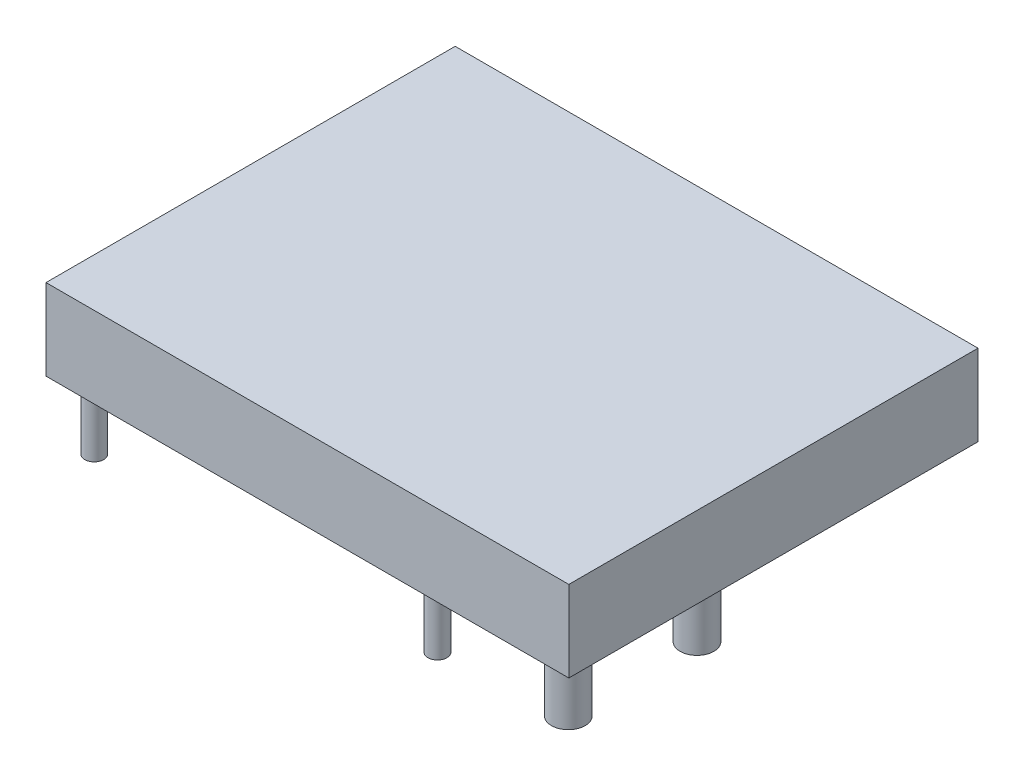
ISO-10303-21;
HEADER;
FILE_DESCRIPTION(('STEP AP214'),'2;1');
FILE_NAME('part.step','',(''),(''),'','','');
FILE_SCHEMA(('AUTOMOTIVE_DESIGN { 1 0 10303 214 1 1 1 1 }'));
ENDSEC;
DATA;
#1=APPLICATION_CONTEXT('core data for automotive mechanical design processes');
#2=APPLICATION_PROTOCOL_DEFINITION('international standard','automotive_design',2000,#1);
#3=PRODUCT_CONTEXT('',#1,'mechanical');
#4=PRODUCT('Part','Part','',(#3));
#5=PRODUCT_RELATED_PRODUCT_CATEGORY('part','',(#4));
#6=PRODUCT_DEFINITION_FORMATION('','',#4);
#7=PRODUCT_DEFINITION_CONTEXT('part definition',#1,'design');
#8=PRODUCT_DEFINITION('design','',#6,#7);
#9=PRODUCT_DEFINITION_SHAPE('','',#8);
#10=(LENGTH_UNIT() NAMED_UNIT(*) SI_UNIT(.MILLI.,.METRE.));
#11=(NAMED_UNIT(*) PLANE_ANGLE_UNIT() SI_UNIT($,.RADIAN.));
#12=(NAMED_UNIT(*) SI_UNIT($,.STERADIAN.) SOLID_ANGLE_UNIT());
#13=UNCERTAINTY_MEASURE_WITH_UNIT(LENGTH_MEASURE(1.E-05),#10,'distance_accuracy_value','');
#14=(GEOMETRIC_REPRESENTATION_CONTEXT(3) GLOBAL_UNCERTAINTY_ASSIGNED_CONTEXT((#13)) GLOBAL_UNIT_ASSIGNED_CONTEXT((#10,
#11,#12)) REPRESENTATION_CONTEXT('',''));
#15=CARTESIAN_POINT('',(0.,0.,0.));
#16=DIRECTION('',(0.,0.,1.));
#17=DIRECTION('',(1.,0.,0.));
#18=AXIS2_PLACEMENT_3D('',#15,#16,#17);
#19=CARTESIAN_POINT('',(0.,8.,0.));
#20=DIRECTION('',(0.,1.,0.));
#21=DIRECTION('',(0.,0.,1.));
#22=AXIS2_PLACEMENT_3D('',#19,#20,#21);
#23=PLANE('',#22);
#24=DIRECTION('',(0.,0.,-1.));
#25=VECTOR('',#24,1.);
#26=CARTESIAN_POINT('',(-60.32012,8.,0.));
#27=LINE('',#26,#25);
#28=CARTESIAN_POINT('',(-60.32012,8.,1.60000000000001));
#29=VERTEX_POINT('',#28);
#30=CARTESIAN_POINT('',(-60.32012,8.,-46.86185));
#31=VERTEX_POINT('',#30);
#32=EDGE_CURVE('E104',#29,#31,#27,.T.);
#33=ORIENTED_EDGE('',*,*,#32,.T.);
#34=DIRECTION('',(1.,0.,0.));
#35=VECTOR('',#34,1.);
#36=CARTESIAN_POINT('',(0.,8.,-46.86185));
#37=LINE('',#36,#35);
#38=CARTESIAN_POINT('',(1.6,8.,-46.86185));
#39=VERTEX_POINT('',#38);
#40=EDGE_CURVE('E54',#31,#39,#37,.T.);
#41=ORIENTED_EDGE('',*,*,#40,.T.);
#42=DIRECTION('',(0.,0.,-1.));
#43=VECTOR('',#42,1.);
#44=CARTESIAN_POINT('',(1.6,8.,0.));
#45=LINE('',#44,#43);
#46=CARTESIAN_POINT('',(1.6,8.,1.6));
#47=VERTEX_POINT('',#46);
#48=EDGE_CURVE('E162',#47,#39,#45,.T.);
#49=ORIENTED_EDGE('',*,*,#48,.F.);
#50=DIRECTION('',(-1.,0.,0.));
#51=VECTOR('',#50,1.);
#52=CARTESIAN_POINT('',(0.,8.,1.6));
#53=LINE('',#52,#51);
#54=EDGE_CURVE('E164',#47,#29,#53,.T.);
#55=ORIENTED_EDGE('',*,*,#54,.T.);
#56=EDGE_LOOP('',(#33,#41,#49,#55));
#57=FACE_BOUND('',#56,.T.);
#58=DIRECTION('',(-1.,0.,0.));
#59=VECTOR('',#58,1.);
#60=CARTESIAN_POINT('',(0.,8.,0.));
#61=LINE('',#60,#59);
#62=CARTESIAN_POINT('',(0.,8.,0.));
#63=VERTEX_POINT('',#62);
#64=CARTESIAN_POINT('',(-58.72012,8.,0.));
#65=VERTEX_POINT('',#64);
#66=EDGE_CURVE('E155',#63,#65,#61,.T.);
#67=ORIENTED_EDGE('',*,*,#66,.F.);
#68=DIRECTION('',(0.,0.,-1.));
#69=VECTOR('',#68,1.);
#70=CARTESIAN_POINT('',(0.,8.,0.));
#71=LINE('',#70,#69);
#72=CARTESIAN_POINT('',(0.,8.,-45.26185));
#73=VERTEX_POINT('',#72);
#74=EDGE_CURVE('E46',#63,#73,#71,.T.);
#75=ORIENTED_EDGE('',*,*,#74,.T.);
#76=DIRECTION('',(1.,0.,0.));
#77=VECTOR('',#76,1.);
#78=CARTESIAN_POINT('',(0.,8.,-45.26185));
#79=LINE('',#78,#77);
#80=CARTESIAN_POINT('',(-58.72012,8.,-45.26185));
#81=VERTEX_POINT('',#80);
#82=EDGE_CURVE('E133',#81,#73,#79,.T.);
#83=ORIENTED_EDGE('',*,*,#82,.F.);
#84=DIRECTION('',(0.,0.,-1.));
#85=VECTOR('',#84,1.);
#86=CARTESIAN_POINT('',(-58.72012,8.,0.));
#87=LINE('',#86,#85);
#88=EDGE_CURVE('E160',#65,#81,#87,.T.);
#89=ORIENTED_EDGE('',*,*,#88,.F.);
#90=EDGE_LOOP('',(#67,#75,#83,#89));
#91=FACE_BOUND('',#90,.T.);
#92=ADVANCED_FACE('F32',(#57,#91),#23,.F.);
#93=CARTESIAN_POINT('',(0.,16.,0.));
#94=DIRECTION('',(0.,0.,1.));
#95=DIRECTION('',(1.,0.,0.));
#96=AXIS2_PLACEMENT_3D('',#93,#94,#95);
#97=PLANE('',#96);
#98=DIRECTION('',(0.,-1.,0.));
#99=VECTOR('',#98,1.);
#100=CARTESIAN_POINT('',(0.,16.,0.));
#101=LINE('',#100,#99);
#102=CARTESIAN_POINT('',(0.,16.,0.));
#103=VERTEX_POINT('',#102);
#104=EDGE_CURVE('E139',#103,#63,#101,.T.);
#105=ORIENTED_EDGE('',*,*,#104,.T.);
#106=ORIENTED_EDGE('',*,*,#66,.T.);
#107=DIRECTION('',(0.,-1.,0.));
#108=VECTOR('',#107,1.);
#109=CARTESIAN_POINT('',(-58.72012,16.,0.));
#110=LINE('',#109,#108);
#111=CARTESIAN_POINT('',(-58.72012,16.,0.));
#112=VERTEX_POINT('',#111);
#113=EDGE_CURVE('E142',#112,#65,#110,.T.);
#114=ORIENTED_EDGE('',*,*,#113,.F.);
#115=DIRECTION('',(-1.,0.,0.));
#116=VECTOR('',#115,1.);
#117=CARTESIAN_POINT('',(0.,16.,0.));
#118=LINE('',#117,#116);
#119=EDGE_CURVE('E145',#103,#112,#118,.T.);
#120=ORIENTED_EDGE('',*,*,#119,.F.);
#121=EDGE_LOOP('',(#105,#106,#114,#120));
#122=FACE_BOUND('',#121,.T.);
#123=ADVANCED_FACE('F187',(#122),#97,.F.);
#124=CARTESIAN_POINT('',(0.,16.,0.));
#125=DIRECTION('',(0.,1.,0.));
#126=DIRECTION('',(0.,0.,1.));
#127=AXIS2_PLACEMENT_3D('',#124,#125,#126);
#128=PLANE('',#127);
#129=CARTESIAN_POINT('',(-16.82012,16.,-1.26000000000001));
#130=DIRECTION('',(0.,1.,0.));
#131=DIRECTION('',(0.,0.,1.));
#132=AXIS2_PLACEMENT_3D('',#129,#130,#131);
#133=CIRCLE('',#132,1.125);
#134=CARTESIAN_POINT('',(-16.82012,16.,-0.13500000000001));
#135=VERTEX_POINT('',#134);
#136=EDGE_CURVE('E11',#135,#135,#133,.F.);
#137=ORIENTED_EDGE('',*,*,#136,.F.);
#138=EDGE_LOOP('',(#137));
#139=FACE_BOUND('',#138,.T.);
#140=CARTESIAN_POINT('',(-16.82012,16.,-16.5));
#141=DIRECTION('',(0.,1.,0.));
#142=DIRECTION('',(0.,0.,1.));
#143=AXIS2_PLACEMENT_3D('',#140,#141,#142);
#144=CIRCLE('',#143,1.125);
#145=CARTESIAN_POINT('',(-16.82012,16.,-15.375));
#146=VERTEX_POINT('',#145);
#147=EDGE_CURVE('E39',#146,#146,#144,.F.);
#148=ORIENTED_EDGE('',*,*,#147,.F.);
#149=EDGE_LOOP('',(#148));
#150=FACE_BOUND('',#149,.T.);
#151=CARTESIAN_POINT('',(-57.46012,16.,-16.5));
#152=DIRECTION('',(0.,1.,0.));
#153=DIRECTION('',(0.,0.,1.));
#154=AXIS2_PLACEMENT_3D('',#151,#152,#153);
#155=CIRCLE('',#154,1.125);
#156=CARTESIAN_POINT('',(-57.46012,16.,-15.375));
#157=VERTEX_POINT('',#156);
#158=EDGE_CURVE('E176',#157,#157,#155,.F.);
#159=ORIENTED_EDGE('',*,*,#158,.F.);
#160=EDGE_LOOP('',(#159));
#161=FACE_BOUND('',#160,.T.);
#162=CARTESIAN_POINT('',(-57.46012,16.,-1.26000000000001));
#163=DIRECTION('',(0.,1.,0.));
#164=DIRECTION('',(0.,0.,1.));
#165=AXIS2_PLACEMENT_3D('',#162,#163,#164);
#166=CIRCLE('',#165,1.125);
#167=CARTESIAN_POINT('',(-57.46012,16.,-0.13500000000001));
#168=VERTEX_POINT('',#167);
#169=EDGE_CURVE('E173',#168,#168,#166,.F.);
#170=ORIENTED_EDGE('',*,*,#169,.F.);
#171=EDGE_LOOP('',(#170));
#172=FACE_BOUND('',#171,.T.);
#173=CARTESIAN_POINT('',(-2.54,16.,-2.48185));
#174=DIRECTION('',(0.,1.,0.));
#175=DIRECTION('',(0.,0.,1.));
#176=AXIS2_PLACEMENT_3D('',#173,#174,#175);
#177=CIRCLE('',#176,2.);
#178=CARTESIAN_POINT('',(-2.54,16.,-0.481849999999997));
#179=VERTEX_POINT('',#178);
#180=EDGE_CURVE('E170',#179,#179,#177,.F.);
#181=ORIENTED_EDGE('',*,*,#180,.F.);
#182=EDGE_LOOP('',(#181));
#183=FACE_BOUND('',#182,.T.);
#184=CARTESIAN_POINT('',(-2.54,16.,-17.72185));
#185=DIRECTION('',(0.,1.,0.));
#186=DIRECTION('',(0.,0.,1.));
#187=AXIS2_PLACEMENT_3D('',#184,#185,#186);
#188=CIRCLE('',#187,2.);
#189=CARTESIAN_POINT('',(-2.54,16.,-15.72185));
#190=VERTEX_POINT('',#189);
#191=EDGE_CURVE('E157',#190,#190,#188,.F.);
#192=ORIENTED_EDGE('',*,*,#191,.F.);
#193=EDGE_LOOP('',(#192));
#194=FACE_BOUND('',#193,.T.);
#195=DIRECTION('',(1.,0.,0.));
#196=VECTOR('',#195,1.);
#197=CARTESIAN_POINT('',(0.,16.,-45.26185));
#198=LINE('',#197,#196);
#199=CARTESIAN_POINT('',(-58.72012,16.,-45.26185));
#200=VERTEX_POINT('',#199);
#201=CARTESIAN_POINT('',(0.,16.,-45.26185));
#202=VERTEX_POINT('',#201);
#203=EDGE_CURVE('E136',#200,#202,#198,.T.);
#204=ORIENTED_EDGE('',*,*,#203,.T.);
#205=DIRECTION('',(0.,0.,-1.));
#206=VECTOR('',#205,1.);
#207=CARTESIAN_POINT('',(0.,16.,0.));
#208=LINE('',#207,#206);
#209=EDGE_CURVE('E131',#103,#202,#208,.T.);
#210=ORIENTED_EDGE('',*,*,#209,.F.);
#211=ORIENTED_EDGE('',*,*,#119,.T.);
#212=DIRECTION('',(0.,0.,-1.));
#213=VECTOR('',#212,1.);
#214=CARTESIAN_POINT('',(-58.72012,16.,0.));
#215=LINE('',#214,#213);
#216=EDGE_CURVE('E151',#112,#200,#215,.T.);
#217=ORIENTED_EDGE('',*,*,#216,.T.);
#218=EDGE_LOOP('',(#204,#210,#211,#217));
#219=FACE_BOUND('',#218,.T.);
#220=ADVANCED_FACE('F183',(#139,#150,#161,#172,#183,#194,#219),#128,.F.);
#221=CARTESIAN_POINT('',(0.,16.,0.));
#222=DIRECTION('',(-1.,0.,0.));
#223=DIRECTION('',(0.,0.,1.));
#224=AXIS2_PLACEMENT_3D('',#221,#222,#223);
#225=PLANE('',#224);
#226=ORIENTED_EDGE('',*,*,#74,.F.);
#227=ORIENTED_EDGE('',*,*,#104,.F.);
#228=ORIENTED_EDGE('',*,*,#209,.T.);
#229=DIRECTION('',(0.,-1.,0.));
#230=VECTOR('',#229,1.);
#231=CARTESIAN_POINT('',(0.,16.,-45.26185));
#232=LINE('',#231,#230);
#233=EDGE_CURVE('E134',#202,#73,#232,.T.);
#234=ORIENTED_EDGE('',*,*,#233,.T.);
#235=EDGE_LOOP('',(#226,#227,#228,#234));
#236=FACE_BOUND('',#235,.T.);
#237=ADVANCED_FACE('F186',(#236),#225,.T.);
#238=CARTESIAN_POINT('',(-58.72012,16.,0.));
#239=DIRECTION('',(-1.,0.,0.));
#240=DIRECTION('',(0.,0.,1.));
#241=AXIS2_PLACEMENT_3D('',#238,#239,#240);
#242=PLANE('',#241);
#243=ORIENTED_EDGE('',*,*,#113,.T.);
#244=ORIENTED_EDGE('',*,*,#88,.T.);
#245=DIRECTION('',(0.,-1.,0.));
#246=VECTOR('',#245,1.);
#247=CARTESIAN_POINT('',(-58.72012,16.,-45.26185));
#248=LINE('',#247,#246);
#249=EDGE_CURVE('E148',#200,#81,#248,.T.);
#250=ORIENTED_EDGE('',*,*,#249,.F.);
#251=ORIENTED_EDGE('',*,*,#216,.F.);
#252=EDGE_LOOP('',(#243,#244,#250,#251));
#253=FACE_BOUND('',#252,.T.);
#254=ADVANCED_FACE('F209',(#253),#242,.F.);
#255=CARTESIAN_POINT('',(0.,16.,-45.26185));
#256=DIRECTION('',(0.,0.,-1.));
#257=DIRECTION('',(-1.,0.,0.));
#258=AXIS2_PLACEMENT_3D('',#255,#256,#257);
#259=PLANE('',#258);
#260=ORIENTED_EDGE('',*,*,#249,.T.);
#261=ORIENTED_EDGE('',*,*,#82,.T.);
#262=ORIENTED_EDGE('',*,*,#233,.F.);
#263=ORIENTED_EDGE('',*,*,#203,.F.);
#264=EDGE_LOOP('',(#260,#261,#262,#263));
#265=FACE_BOUND('',#264,.T.);
#266=ADVANCED_FACE('F205',(#265),#259,.F.);
#267=CARTESIAN_POINT('',(-60.32012,16.,0.));
#268=DIRECTION('',(-1.,0.,0.));
#269=DIRECTION('',(0.,0.,1.));
#270=AXIS2_PLACEMENT_3D('',#267,#268,#269);
#271=PLANE('',#270);
#272=ORIENTED_EDGE('',*,*,#32,.F.);
#273=DIRECTION('',(0.,-1.,0.));
#274=VECTOR('',#273,1.);
#275=CARTESIAN_POINT('',(-60.32012,16.,1.60000000000001));
#276=LINE('',#275,#274);
#277=CARTESIAN_POINT('',(-60.32012,17.6,1.60000000000001));
#278=VERTEX_POINT('',#277);
#279=EDGE_CURVE('E99',#278,#29,#276,.T.);
#280=ORIENTED_EDGE('',*,*,#279,.F.);
#281=DIRECTION('',(0.,0.,-1.));
#282=VECTOR('',#281,1.);
#283=CARTESIAN_POINT('',(-60.32012,17.6,0.));
#284=LINE('',#283,#282);
#285=CARTESIAN_POINT('',(-60.32012,17.6,-46.86185));
#286=VERTEX_POINT('',#285);
#287=EDGE_CURVE('E103',#278,#286,#284,.T.);
#288=ORIENTED_EDGE('',*,*,#287,.T.);
#289=DIRECTION('',(0.,-1.,0.));
#290=VECTOR('',#289,1.);
#291=CARTESIAN_POINT('',(-60.32012,16.,-46.86185));
#292=LINE('',#291,#290);
#293=EDGE_CURVE('E107',#286,#31,#292,.T.);
#294=ORIENTED_EDGE('',*,*,#293,.T.);
#295=EDGE_LOOP('',(#272,#280,#288,#294));
#296=FACE_BOUND('',#295,.T.);
#297=ADVANCED_FACE('F101',(#296),#271,.T.);
#298=CARTESIAN_POINT('',(0.,16.,1.6));
#299=DIRECTION('',(0.,0.,1.));
#300=DIRECTION('',(1.,0.,0.));
#301=AXIS2_PLACEMENT_3D('',#298,#299,#300);
#302=PLANE('',#301);
#303=ORIENTED_EDGE('',*,*,#54,.F.);
#304=DIRECTION('',(0.,-1.,0.));
#305=VECTOR('',#304,1.);
#306=CARTESIAN_POINT('',(1.6,16.,1.6));
#307=LINE('',#306,#305);
#308=CARTESIAN_POINT('',(1.6,17.6,1.6));
#309=VERTEX_POINT('',#308);
#310=EDGE_CURVE('E108',#309,#47,#307,.T.);
#311=ORIENTED_EDGE('',*,*,#310,.F.);
#312=DIRECTION('',(-1.,0.,0.));
#313=VECTOR('',#312,1.);
#314=CARTESIAN_POINT('',(0.,17.6,1.6));
#315=LINE('',#314,#313);
#316=EDGE_CURVE('E114',#309,#278,#315,.T.);
#317=ORIENTED_EDGE('',*,*,#316,.T.);
#318=ORIENTED_EDGE('',*,*,#279,.T.);
#319=EDGE_LOOP('',(#303,#311,#317,#318));
#320=FACE_BOUND('',#319,.T.);
#321=ADVANCED_FACE('F118',(#320),#302,.T.);
#322=CARTESIAN_POINT('',(1.6,16.,0.));
#323=DIRECTION('',(-1.,0.,0.));
#324=DIRECTION('',(0.,0.,1.));
#325=AXIS2_PLACEMENT_3D('',#322,#323,#324);
#326=PLANE('',#325);
#327=ORIENTED_EDGE('',*,*,#310,.T.);
#328=ORIENTED_EDGE('',*,*,#48,.T.);
#329=DIRECTION('',(0.,-1.,0.));
#330=VECTOR('',#329,1.);
#331=CARTESIAN_POINT('',(1.6,16.,-46.86185));
#332=LINE('',#331,#330);
#333=CARTESIAN_POINT('',(1.6,17.6,-46.86185));
#334=VERTEX_POINT('',#333);
#335=EDGE_CURVE('E123',#334,#39,#332,.T.);
#336=ORIENTED_EDGE('',*,*,#335,.F.);
#337=DIRECTION('',(0.,0.,-1.));
#338=VECTOR('',#337,1.);
#339=CARTESIAN_POINT('',(1.6,17.6,0.));
#340=LINE('',#339,#338);
#341=EDGE_CURVE('E121',#309,#334,#340,.T.);
#342=ORIENTED_EDGE('',*,*,#341,.F.);
#343=EDGE_LOOP('',(#327,#328,#336,#342));
#344=FACE_BOUND('',#343,.T.);
#345=ADVANCED_FACE('F228',(#344),#326,.F.);
#346=CARTESIAN_POINT('',(0.,16.,-46.86185));
#347=DIRECTION('',(0.,0.,-1.));
#348=DIRECTION('',(-1.,0.,0.));
#349=AXIS2_PLACEMENT_3D('',#346,#347,#348);
#350=PLANE('',#349);
#351=ORIENTED_EDGE('',*,*,#40,.F.);
#352=ORIENTED_EDGE('',*,*,#293,.F.);
#353=DIRECTION('',(1.,0.,0.));
#354=VECTOR('',#353,1.);
#355=CARTESIAN_POINT('',(0.,17.6,-46.86185));
#356=LINE('',#355,#354);
#357=EDGE_CURVE('E116',#286,#334,#356,.T.);
#358=ORIENTED_EDGE('',*,*,#357,.T.);
#359=ORIENTED_EDGE('',*,*,#335,.T.);
#360=EDGE_LOOP('',(#351,#352,#358,#359));
#361=FACE_BOUND('',#360,.T.);
#362=ADVANCED_FACE('F219',(#361),#350,.T.);
#363=CARTESIAN_POINT('',(0.,17.6,0.));
#364=DIRECTION('',(0.,1.,0.));
#365=DIRECTION('',(0.,0.,1.));
#366=AXIS2_PLACEMENT_3D('',#363,#364,#365);
#367=PLANE('',#366);
#368=ORIENTED_EDGE('',*,*,#357,.F.);
#369=ORIENTED_EDGE('',*,*,#287,.F.);
#370=ORIENTED_EDGE('',*,*,#316,.F.);
#371=ORIENTED_EDGE('',*,*,#341,.T.);
#372=EDGE_LOOP('',(#368,#369,#370,#371));
#373=FACE_BOUND('',#372,.T.);
#374=ADVANCED_FACE('F113',(#373),#367,.T.);
#375=CARTESIAN_POINT('',(-2.54,0.,-17.72185));
#376=DIRECTION('',(0.,-1.,0.));
#377=DIRECTION('',(0.,0.,-1.));
#378=AXIS2_PLACEMENT_3D('',#375,#376,#377);
#379=PLANE('',#378);
#380=CARTESIAN_POINT('',(-2.54,0.,-17.72185));
#381=DIRECTION('',(0.,-1.,0.));
#382=DIRECTION('',(0.,0.,-1.));
#383=AXIS2_PLACEMENT_3D('',#380,#381,#382);
#384=CIRCLE('',#383,2.);
#385=CARTESIAN_POINT('',(-2.54,0.,-19.72185));
#386=VERTEX_POINT('',#385);
#387=EDGE_CURVE('E130',#386,#386,#384,.T.);
#388=ORIENTED_EDGE('',*,*,#387,.T.);
#389=EDGE_LOOP('',(#388));
#390=FACE_BOUND('',#389,.T.);
#391=CARTESIAN_POINT('',(-2.54,0.,-17.72185));
#392=DIRECTION('',(0.,-1.,0.));
#393=DIRECTION('',(0.,0.,-1.));
#394=AXIS2_PLACEMENT_3D('',#391,#392,#393);
#395=CIRCLE('',#394,1.5);
#396=CARTESIAN_POINT('',(-2.54,0.,-19.22185));
#397=VERTEX_POINT('',#396);
#398=EDGE_CURVE('E255',#397,#397,#395,.T.);
#399=ORIENTED_EDGE('',*,*,#398,.F.);
#400=EDGE_LOOP('',(#399));
#401=FACE_BOUND('',#400,.T.);
#402=ADVANCED_FACE('F217',(#390,#401),#379,.T.);
#403=CARTESIAN_POINT('',(-2.54,0.,-17.72185));
#404=DIRECTION('',(0.,1.,0.));
#405=DIRECTION('',(0.,0.,1.));
#406=AXIS2_PLACEMENT_3D('',#403,#404,#405);
#407=CYLINDRICAL_SURFACE('',#406,2.);
#408=ORIENTED_EDGE('',*,*,#387,.F.);
#409=EDGE_LOOP('',(#408));
#410=FACE_BOUND('',#409,.T.);
#411=ORIENTED_EDGE('',*,*,#191,.T.);
#412=EDGE_LOOP('',(#411));
#413=FACE_BOUND('',#412,.T.);
#414=ADVANCED_FACE('F225',(#410,#413),#407,.T.);
#415=CARTESIAN_POINT('',(-2.54,0.,-17.72185));
#416=DIRECTION('',(0.,1.,0.));
#417=DIRECTION('',(0.,0.,1.));
#418=AXIS2_PLACEMENT_3D('',#415,#416,#417);
#419=CYLINDRICAL_SURFACE('',#418,1.5);
#420=ORIENTED_EDGE('',*,*,#398,.T.);
#421=EDGE_LOOP('',(#420));
#422=FACE_BOUND('',#421,.T.);
#423=CARTESIAN_POINT('',(-2.54,16.,-17.72185));
#424=DIRECTION('',(0.,-1.,0.));
#425=DIRECTION('',(0.,0.,-1.));
#426=AXIS2_PLACEMENT_3D('',#423,#424,#425);
#427=CIRCLE('',#426,1.5);
#428=CARTESIAN_POINT('',(-2.54,16.,-19.22185));
#429=VERTEX_POINT('',#428);
#430=EDGE_CURVE('E256',#429,#429,#427,.T.);
#431=ORIENTED_EDGE('',*,*,#430,.F.);
#432=EDGE_LOOP('',(#431));
#433=FACE_BOUND('',#432,.T.);
#434=ADVANCED_FACE('F375',(#422,#433),#419,.F.);
#435=ORIENTED_EDGE('',*,*,#430,.T.);
#436=EDGE_LOOP('',(#435));
#437=FACE_BOUND('',#436,.T.);
#438=ADVANCED_FACE('F190',(#437),#128,.F.);
#439=CARTESIAN_POINT('',(-2.54,0.,-2.48185));
#440=DIRECTION('',(0.,-1.,0.));
#441=DIRECTION('',(0.,0.,-1.));
#442=AXIS2_PLACEMENT_3D('',#439,#440,#441);
#443=PLANE('',#442);
#444=CARTESIAN_POINT('',(-2.54,0.,-2.48185));
#445=DIRECTION('',(0.,-1.,0.));
#446=DIRECTION('',(0.,0.,-1.));
#447=AXIS2_PLACEMENT_3D('',#444,#445,#446);
#448=CIRCLE('',#447,2.);
#449=CARTESIAN_POINT('',(-2.54,0.,-4.48185));
#450=VERTEX_POINT('',#449);
#451=EDGE_CURVE('E259',#450,#450,#448,.T.);
#452=ORIENTED_EDGE('',*,*,#451,.T.);
#453=EDGE_LOOP('',(#452));
#454=FACE_BOUND('',#453,.T.);
#455=CARTESIAN_POINT('',(-2.54,0.,-2.48185));
#456=DIRECTION('',(0.,-1.,0.));
#457=DIRECTION('',(0.,0.,-1.));
#458=AXIS2_PLACEMENT_3D('',#455,#456,#457);
#459=CIRCLE('',#458,1.5);
#460=CARTESIAN_POINT('',(-2.54,0.,-3.98185));
#461=VERTEX_POINT('',#460);
#462=EDGE_CURVE('E264',#461,#461,#459,.T.);
#463=ORIENTED_EDGE('',*,*,#462,.F.);
#464=EDGE_LOOP('',(#463));
#465=FACE_BOUND('',#464,.T.);
#466=ADVANCED_FACE('F368',(#454,#465),#443,.T.);
#467=CARTESIAN_POINT('',(-2.54,0.,-2.48185));
#468=DIRECTION('',(0.,1.,0.));
#469=DIRECTION('',(0.,0.,1.));
#470=AXIS2_PLACEMENT_3D('',#467,#468,#469);
#471=CYLINDRICAL_SURFACE('',#470,2.);
#472=ORIENTED_EDGE('',*,*,#451,.F.);
#473=EDGE_LOOP('',(#472));
#474=FACE_BOUND('',#473,.T.);
#475=ORIENTED_EDGE('',*,*,#180,.T.);
#476=EDGE_LOOP('',(#475));
#477=FACE_BOUND('',#476,.T.);
#478=ADVANCED_FACE('F366',(#474,#477),#471,.T.);
#479=CARTESIAN_POINT('',(-2.54,0.,-2.48185));
#480=DIRECTION('',(0.,1.,0.));
#481=DIRECTION('',(0.,0.,1.));
#482=AXIS2_PLACEMENT_3D('',#479,#480,#481);
#483=CYLINDRICAL_SURFACE('',#482,1.5);
#484=ORIENTED_EDGE('',*,*,#462,.T.);
#485=EDGE_LOOP('',(#484));
#486=FACE_BOUND('',#485,.T.);
#487=CARTESIAN_POINT('',(-2.54,16.,-2.48185));
#488=DIRECTION('',(0.,-1.,0.));
#489=DIRECTION('',(0.,0.,-1.));
#490=AXIS2_PLACEMENT_3D('',#487,#488,#489);
#491=CIRCLE('',#490,1.5);
#492=CARTESIAN_POINT('',(-2.54,16.,-3.98185));
#493=VERTEX_POINT('',#492);
#494=EDGE_CURVE('E265',#493,#493,#491,.T.);
#495=ORIENTED_EDGE('',*,*,#494,.F.);
#496=EDGE_LOOP('',(#495));
#497=FACE_BOUND('',#496,.T.);
#498=ADVANCED_FACE('F363',(#486,#497),#483,.F.);
#499=ORIENTED_EDGE('',*,*,#494,.T.);
#500=EDGE_LOOP('',(#499));
#501=FACE_BOUND('',#500,.T.);
#502=ADVANCED_FACE('F358',(#501),#128,.F.);
#503=CARTESIAN_POINT('',(-57.46012,0.,-1.26000000000001));
#504=DIRECTION('',(0.,-1.,0.));
#505=DIRECTION('',(0.,0.,-1.));
#506=AXIS2_PLACEMENT_3D('',#503,#504,#505);
#507=PLANE('',#506);
#508=CARTESIAN_POINT('',(-57.46012,0.,-1.26000000000001));
#509=DIRECTION('',(0.,-1.,0.));
#510=DIRECTION('',(0.,0.,-1.));
#511=AXIS2_PLACEMENT_3D('',#508,#509,#510);
#512=CIRCLE('',#511,1.125);
#513=CARTESIAN_POINT('',(-57.46012,0.,-2.38500000000001));
#514=VERTEX_POINT('',#513);
#515=EDGE_CURVE('E268',#514,#514,#512,.T.);
#516=ORIENTED_EDGE('',*,*,#515,.T.);
#517=EDGE_LOOP('',(#516));
#518=FACE_BOUND('',#517,.T.);
#519=CARTESIAN_POINT('',(-57.46012,0.,-1.26000000000001));
#520=DIRECTION('',(0.,-1.,0.));
#521=DIRECTION('',(0.,0.,-1.));
#522=AXIS2_PLACEMENT_3D('',#519,#520,#521);
#523=CIRCLE('',#522,0.825000000000001);
#524=CARTESIAN_POINT('',(-57.46012,0.,-2.08500000000001));
#525=VERTEX_POINT('',#524);
#526=EDGE_CURVE('E273',#525,#525,#523,.T.);
#527=ORIENTED_EDGE('',*,*,#526,.F.);
#528=EDGE_LOOP('',(#527));
#529=FACE_BOUND('',#528,.T.);
#530=ADVANCED_FACE('F355',(#518,#529),#507,.T.);
#531=CARTESIAN_POINT('',(-57.46012,0.,-1.26000000000001));
#532=DIRECTION('',(0.,1.,0.));
#533=DIRECTION('',(0.,0.,1.));
#534=AXIS2_PLACEMENT_3D('',#531,#532,#533);
#535=CYLINDRICAL_SURFACE('',#534,1.125);
#536=ORIENTED_EDGE('',*,*,#515,.F.);
#537=EDGE_LOOP('',(#536));
#538=FACE_BOUND('',#537,.T.);
#539=ORIENTED_EDGE('',*,*,#169,.T.);
#540=EDGE_LOOP('',(#539));
#541=FACE_BOUND('',#540,.T.);
#542=ADVANCED_FACE('F353',(#538,#541),#535,.T.);
#543=CARTESIAN_POINT('',(-57.46012,0.,-1.26000000000001));
#544=DIRECTION('',(0.,1.,0.));
#545=DIRECTION('',(0.,0.,1.));
#546=AXIS2_PLACEMENT_3D('',#543,#544,#545);
#547=CYLINDRICAL_SURFACE('',#546,0.825000000000001);
#548=ORIENTED_EDGE('',*,*,#526,.T.);
#549=EDGE_LOOP('',(#548));
#550=FACE_BOUND('',#549,.T.);
#551=CARTESIAN_POINT('',(-57.46012,16.,-1.26000000000001));
#552=DIRECTION('',(0.,-1.,0.));
#553=DIRECTION('',(0.,0.,-1.));
#554=AXIS2_PLACEMENT_3D('',#551,#552,#553);
#555=CIRCLE('',#554,0.825000000000001);
#556=CARTESIAN_POINT('',(-57.46012,16.,-2.08500000000001));
#557=VERTEX_POINT('',#556);
#558=EDGE_CURVE('E274',#557,#557,#555,.T.);
#559=ORIENTED_EDGE('',*,*,#558,.F.);
#560=EDGE_LOOP('',(#559));
#561=FACE_BOUND('',#560,.T.);
#562=ADVANCED_FACE('F350',(#550,#561),#547,.F.);
#563=ORIENTED_EDGE('',*,*,#558,.T.);
#564=EDGE_LOOP('',(#563));
#565=FACE_BOUND('',#564,.T.);
#566=ADVANCED_FACE('F345',(#565),#128,.F.);
#567=CARTESIAN_POINT('',(-57.46012,0.,-16.5));
#568=DIRECTION('',(0.,-1.,0.));
#569=DIRECTION('',(0.,0.,-1.));
#570=AXIS2_PLACEMENT_3D('',#567,#568,#569);
#571=PLANE('',#570);
#572=CARTESIAN_POINT('',(-57.46012,0.,-16.5));
#573=DIRECTION('',(0.,-1.,0.));
#574=DIRECTION('',(0.,0.,-1.));
#575=AXIS2_PLACEMENT_3D('',#572,#573,#574);
#576=CIRCLE('',#575,1.125);
#577=CARTESIAN_POINT('',(-57.46012,0.,-17.625));
#578=VERTEX_POINT('',#577);
#579=EDGE_CURVE('E277',#578,#578,#576,.T.);
#580=ORIENTED_EDGE('',*,*,#579,.T.);
#581=EDGE_LOOP('',(#580));
#582=FACE_BOUND('',#581,.T.);
#583=CARTESIAN_POINT('',(-57.46012,0.,-16.5));
#584=DIRECTION('',(0.,-1.,0.));
#585=DIRECTION('',(0.,0.,-1.));
#586=AXIS2_PLACEMENT_3D('',#583,#584,#585);
#587=CIRCLE('',#586,0.825000000000001);
#588=CARTESIAN_POINT('',(-57.46012,0.,-17.325));
#589=VERTEX_POINT('',#588);
#590=EDGE_CURVE('E282',#589,#589,#587,.T.);
#591=ORIENTED_EDGE('',*,*,#590,.F.);
#592=EDGE_LOOP('',(#591));
#593=FACE_BOUND('',#592,.T.);
#594=ADVANCED_FACE('F342',(#582,#593),#571,.T.);
#595=CARTESIAN_POINT('',(-57.46012,0.,-16.5));
#596=DIRECTION('',(0.,1.,0.));
#597=DIRECTION('',(0.,0.,1.));
#598=AXIS2_PLACEMENT_3D('',#595,#596,#597);
#599=CYLINDRICAL_SURFACE('',#598,1.125);
#600=ORIENTED_EDGE('',*,*,#579,.F.);
#601=EDGE_LOOP('',(#600));
#602=FACE_BOUND('',#601,.T.);
#603=ORIENTED_EDGE('',*,*,#158,.T.);
#604=EDGE_LOOP('',(#603));
#605=FACE_BOUND('',#604,.T.);
#606=ADVANCED_FACE('F340',(#602,#605),#599,.T.);
#607=CARTESIAN_POINT('',(-57.46012,0.,-16.5));
#608=DIRECTION('',(0.,1.,0.));
#609=DIRECTION('',(0.,0.,1.));
#610=AXIS2_PLACEMENT_3D('',#607,#608,#609);
#611=CYLINDRICAL_SURFACE('',#610,0.825000000000001);
#612=ORIENTED_EDGE('',*,*,#590,.T.);
#613=EDGE_LOOP('',(#612));
#614=FACE_BOUND('',#613,.T.);
#615=CARTESIAN_POINT('',(-57.46012,16.,-16.5));
#616=DIRECTION('',(0.,-1.,0.));
#617=DIRECTION('',(0.,0.,-1.));
#618=AXIS2_PLACEMENT_3D('',#615,#616,#617);
#619=CIRCLE('',#618,0.825000000000001);
#620=CARTESIAN_POINT('',(-57.46012,16.,-17.325));
#621=VERTEX_POINT('',#620);
#622=EDGE_CURVE('E283',#621,#621,#619,.T.);
#623=ORIENTED_EDGE('',*,*,#622,.F.);
#624=EDGE_LOOP('',(#623));
#625=FACE_BOUND('',#624,.T.);
#626=ADVANCED_FACE('F337',(#614,#625),#611,.F.);
#627=ORIENTED_EDGE('',*,*,#622,.T.);
#628=EDGE_LOOP('',(#627));
#629=FACE_BOUND('',#628,.T.);
#630=ADVANCED_FACE('F324',(#629),#128,.F.);
#631=CARTESIAN_POINT('',(-16.82012,0.,-16.5));
#632=DIRECTION('',(0.,1.,0.));
#633=DIRECTION('',(0.,0.,1.));
#634=AXIS2_PLACEMENT_3D('',#631,#632,#633);
#635=PLANE('',#634);
#636=CARTESIAN_POINT('',(-16.82012,0.,-16.5));
#637=DIRECTION('',(0.,-1.,0.));
#638=DIRECTION('',(0.,0.,1.));
#639=AXIS2_PLACEMENT_3D('',#636,#637,#638);
#640=CIRCLE('',#639,1.125);
#641=CARTESIAN_POINT('',(-16.82012,0.,-15.375));
#642=VERTEX_POINT('',#641);
#643=EDGE_CURVE('E286',#642,#642,#640,.T.);
#644=ORIENTED_EDGE('',*,*,#643,.T.);
#645=EDGE_LOOP('',(#644));
#646=FACE_BOUND('',#645,.T.);
#647=CARTESIAN_POINT('',(-16.82012,0.,-16.5));
#648=DIRECTION('',(0.,-1.,0.));
#649=DIRECTION('',(0.,0.,1.));
#650=AXIS2_PLACEMENT_3D('',#647,#648,#649);
#651=CIRCLE('',#650,0.825000000000001);
#652=CARTESIAN_POINT('',(-16.82012,0.,-15.675));
#653=VERTEX_POINT('',#652);
#654=EDGE_CURVE('E291',#653,#653,#651,.T.);
#655=ORIENTED_EDGE('',*,*,#654,.F.);
#656=EDGE_LOOP('',(#655));
#657=FACE_BOUND('',#656,.T.);
#658=ADVANCED_FACE('F330',(#646,#657),#635,.F.);
#659=CARTESIAN_POINT('',(-16.82012,0.,-16.5));
#660=DIRECTION('',(0.,1.,0.));
#661=DIRECTION('',(0.,0.,1.));
#662=AXIS2_PLACEMENT_3D('',#659,#660,#661);
#663=CYLINDRICAL_SURFACE('',#662,1.125);
#664=ORIENTED_EDGE('',*,*,#643,.F.);
#665=EDGE_LOOP('',(#664));
#666=FACE_BOUND('',#665,.T.);
#667=ORIENTED_EDGE('',*,*,#147,.T.);
#668=EDGE_LOOP('',(#667));
#669=FACE_BOUND('',#668,.T.);
#670=ADVANCED_FACE('F181',(#666,#669),#663,.T.);
#671=CARTESIAN_POINT('',(-16.82012,0.,-16.5));
#672=DIRECTION('',(0.,1.,0.));
#673=DIRECTION('',(0.,0.,1.));
#674=AXIS2_PLACEMENT_3D('',#671,#672,#673);
#675=CYLINDRICAL_SURFACE('',#674,0.825000000000001);
#676=ORIENTED_EDGE('',*,*,#654,.T.);
#677=EDGE_LOOP('',(#676));
#678=FACE_BOUND('',#677,.T.);
#679=CARTESIAN_POINT('',(-16.82012,16.,-16.5));
#680=DIRECTION('',(0.,-1.,0.));
#681=DIRECTION('',(0.,0.,1.));
#682=AXIS2_PLACEMENT_3D('',#679,#680,#681);
#683=CIRCLE('',#682,0.825000000000001);
#684=CARTESIAN_POINT('',(-16.82012,16.,-15.675));
#685=VERTEX_POINT('',#684);
#686=EDGE_CURVE('E292',#685,#685,#683,.T.);
#687=ORIENTED_EDGE('',*,*,#686,.F.);
#688=EDGE_LOOP('',(#687));
#689=FACE_BOUND('',#688,.T.);
#690=ADVANCED_FACE('F322',(#678,#689),#675,.F.);
#691=ORIENTED_EDGE('',*,*,#686,.T.);
#692=EDGE_LOOP('',(#691));
#693=FACE_BOUND('',#692,.T.);
#694=ADVANCED_FACE('F313',(#693),#128,.F.);
#695=CARTESIAN_POINT('',(-16.82012,0.,-1.26000000000001));
#696=DIRECTION('',(0.,1.,0.));
#697=DIRECTION('',(0.,0.,1.));
#698=AXIS2_PLACEMENT_3D('',#695,#696,#697);
#699=PLANE('',#698);
#700=CARTESIAN_POINT('',(-16.82012,0.,-1.26000000000001));
#701=DIRECTION('',(0.,-1.,0.));
#702=DIRECTION('',(0.,0.,1.));
#703=AXIS2_PLACEMENT_3D('',#700,#701,#702);
#704=CIRCLE('',#703,1.125);
#705=CARTESIAN_POINT('',(-16.82012,0.,-0.13500000000001));
#706=VERTEX_POINT('',#705);
#707=EDGE_CURVE('E295',#706,#706,#704,.T.);
#708=ORIENTED_EDGE('',*,*,#707,.T.);
#709=EDGE_LOOP('',(#708));
#710=FACE_BOUND('',#709,.T.);
#711=CARTESIAN_POINT('',(-16.82012,0.,-1.26000000000001));
#712=DIRECTION('',(0.,-1.,0.));
#713=DIRECTION('',(0.,0.,1.));
#714=AXIS2_PLACEMENT_3D('',#711,#712,#713);
#715=CIRCLE('',#714,0.825000000000001);
#716=CARTESIAN_POINT('',(-16.82012,0.,-0.435000000000007));
#717=VERTEX_POINT('',#716);
#718=EDGE_CURVE('E300',#717,#717,#715,.T.);
#719=ORIENTED_EDGE('',*,*,#718,.F.);
#720=EDGE_LOOP('',(#719));
#721=FACE_BOUND('',#720,.T.);
#722=ADVANCED_FACE('F310',(#710,#721),#699,.F.);
#723=CARTESIAN_POINT('',(-16.82012,0.,-1.26000000000001));
#724=DIRECTION('',(0.,1.,0.));
#725=DIRECTION('',(0.,0.,1.));
#726=AXIS2_PLACEMENT_3D('',#723,#724,#725);
#727=CYLINDRICAL_SURFACE('',#726,1.125);
#728=ORIENTED_EDGE('',*,*,#707,.F.);
#729=EDGE_LOOP('',(#728));
#730=FACE_BOUND('',#729,.T.);
#731=ORIENTED_EDGE('',*,*,#136,.T.);
#732=EDGE_LOOP('',(#731));
#733=FACE_BOUND('',#732,.T.);
#734=ADVANCED_FACE('F312',(#730,#733),#727,.T.);
#735=CARTESIAN_POINT('',(-16.82012,0.,-1.26000000000001));
#736=DIRECTION('',(0.,1.,0.));
#737=DIRECTION('',(0.,0.,1.));
#738=AXIS2_PLACEMENT_3D('',#735,#736,#737);
#739=CYLINDRICAL_SURFACE('',#738,0.825000000000001);
#740=ORIENTED_EDGE('',*,*,#718,.T.);
#741=EDGE_LOOP('',(#740));
#742=FACE_BOUND('',#741,.T.);
#743=CARTESIAN_POINT('',(-16.82012,16.,-1.26000000000001));
#744=DIRECTION('',(0.,-1.,0.));
#745=DIRECTION('',(0.,0.,1.));
#746=AXIS2_PLACEMENT_3D('',#743,#744,#745);
#747=CIRCLE('',#746,0.825000000000001);
#748=CARTESIAN_POINT('',(-16.82012,16.,-0.435000000000007));
#749=VERTEX_POINT('',#748);
#750=EDGE_CURVE('E301',#749,#749,#747,.T.);
#751=ORIENTED_EDGE('',*,*,#750,.F.);
#752=EDGE_LOOP('',(#751));
#753=FACE_BOUND('',#752,.T.);
#754=ADVANCED_FACE('F307',(#742,#753),#739,.F.);
#755=ORIENTED_EDGE('',*,*,#750,.T.);
#756=EDGE_LOOP('',(#755));
#757=FACE_BOUND('',#756,.T.);
#758=ADVANCED_FACE('F189',(#757),#128,.F.);
#759=CLOSED_SHELL('',(#92,#123,#220,#237,#254,#266,#297,#321,#345,#362,#374,#402,#414,#434,#438,
#466,#478,#498,#502,#530,#542,#562,#566,#594,#606,#626,#630,#658,#670,#690,#694,#722,#734,#754,#758));
#760=MANIFOLD_SOLID_BREP('B2',#759);
#761=ADVANCED_BREP_SHAPE_REPRESENTATION('',(#18,#760),#14);
#762=SHAPE_DEFINITION_REPRESENTATION(#9,#761);
ENDSEC;
END-ISO-10303-21;
